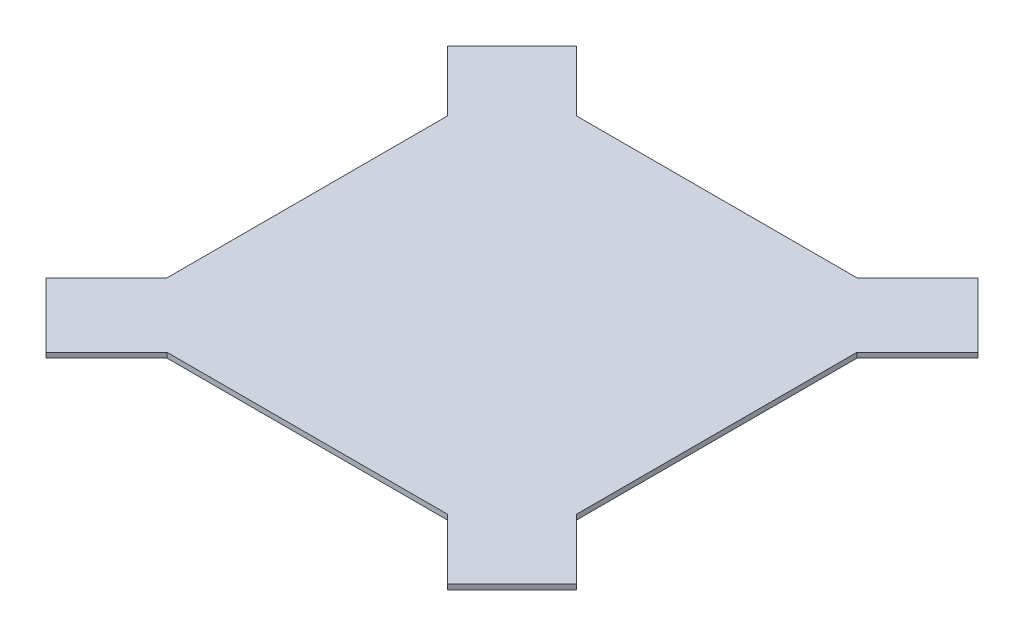
ISO-10303-21;
HEADER;
FILE_DESCRIPTION(('STEP AP214'),'2;1');
FILE_NAME('part.step','',(''),(''),'','','');
FILE_SCHEMA(('AUTOMOTIVE_DESIGN { 1 0 10303 214 1 1 1 1 }'));
ENDSEC;
DATA;
#1=APPLICATION_CONTEXT('core data for automotive mechanical design processes');
#2=APPLICATION_PROTOCOL_DEFINITION('international standard','automotive_design',2000,#1);
#3=PRODUCT_CONTEXT('',#1,'mechanical');
#4=PRODUCT('Part','Part','',(#3));
#5=PRODUCT_RELATED_PRODUCT_CATEGORY('part','',(#4));
#6=PRODUCT_DEFINITION_FORMATION('','',#4);
#7=PRODUCT_DEFINITION_CONTEXT('part definition',#1,'design');
#8=PRODUCT_DEFINITION('design','',#6,#7);
#9=PRODUCT_DEFINITION_SHAPE('','',#8);
#10=(LENGTH_UNIT() NAMED_UNIT(*) SI_UNIT(.MILLI.,.METRE.));
#11=(NAMED_UNIT(*) PLANE_ANGLE_UNIT() SI_UNIT($,.RADIAN.));
#12=(NAMED_UNIT(*) SI_UNIT($,.STERADIAN.) SOLID_ANGLE_UNIT());
#13=UNCERTAINTY_MEASURE_WITH_UNIT(LENGTH_MEASURE(1.E-05),#10,'distance_accuracy_value','');
#14=(GEOMETRIC_REPRESENTATION_CONTEXT(3) GLOBAL_UNCERTAINTY_ASSIGNED_CONTEXT((#13)) GLOBAL_UNIT_ASSIGNED_CONTEXT((#10,
#11,#12)) REPRESENTATION_CONTEXT('',''));
#15=CARTESIAN_POINT('',(0.,0.,0.));
#16=DIRECTION('',(0.,0.,1.));
#17=DIRECTION('',(1.,0.,0.));
#18=AXIS2_PLACEMENT_3D('',#15,#16,#17);
#19=CARTESIAN_POINT('',(0.,-6.35,0.));
#20=DIRECTION('',(0.,1.,0.));
#21=DIRECTION('',(0.,0.,1.));
#22=AXIS2_PLACEMENT_3D('',#19,#20,#21);
#23=PLANE('',#22);
#24=DIRECTION('',(0.707106781186547,0.,0.707106781186548));
#25=VECTOR('',#24,1.);
#26=CARTESIAN_POINT('',(-40.4111525448105,-6.35,40.4111525448104));
#27=LINE('',#26,#25);
#28=CARTESIAN_POINT('',(175.260000044,-6.35,256.082305133621));
#29=VERTEX_POINT('',#28);
#30=CARTESIAN_POINT('',(251.046104704089,-6.35,331.86840979371));
#31=VERTEX_POINT('',#30);
#32=EDGE_CURVE('E344',#29,#31,#27,.T.);
#33=ORIENTED_EDGE('',*,*,#32,.F.);
#34=DIRECTION('',(-1.,0.,0.));
#35=VECTOR('',#34,1.);
#36=CARTESIAN_POINT('',(0.,-6.35,256.082305133621));
#37=LINE('',#36,#35);
#38=CARTESIAN_POINT('',(-175.260000044,-6.35,256.082305133621));
#39=VERTEX_POINT('',#38);
#40=EDGE_CURVE('E329',#29,#39,#37,.T.);
#41=ORIENTED_EDGE('',*,*,#40,.T.);
#42=DIRECTION('',(-0.707106781186547,0.,0.707106781186548));
#43=VECTOR('',#42,1.);
#44=CARTESIAN_POINT('',(40.4111525448105,-6.35,40.4111525448104));
#45=LINE('',#44,#43);
#46=CARTESIAN_POINT('',(-251.046104704089,-6.35,331.86840979371));
#47=VERTEX_POINT('',#46);
#48=EDGE_CURVE('E348',#39,#47,#45,.T.);
#49=ORIENTED_EDGE('',*,*,#48,.T.);
#50=DIRECTION('',(0.707106781186549,0.,0.707106781186546));
#51=VECTOR('',#50,1.);
#52=CARTESIAN_POINT('',(-291.457257248899,-6.35,291.4572572489));
#53=LINE('',#52,#51);
#54=CARTESIAN_POINT('',(-331.868409793711,-6.35,251.046104704089));
#55=VERTEX_POINT('',#54);
#56=EDGE_CURVE('E388',#55,#47,#53,.T.);
#57=ORIENTED_EDGE('',*,*,#56,.F.);
#58=DIRECTION('',(-0.707106781186551,0.,0.707106781186544));
#59=VECTOR('',#58,1.);
#60=CARTESIAN_POINT('',(-40.4111525448092,-6.35,-40.4111525448096));
#61=LINE('',#60,#59);
#62=CARTESIAN_POINT('',(-256.082305133621,-6.35,175.260000044));
#63=VERTEX_POINT('',#62);
#64=EDGE_CURVE('E391',#63,#55,#61,.T.);
#65=ORIENTED_EDGE('',*,*,#64,.F.);
#66=DIRECTION('',(0.,0.,1.));
#67=VECTOR('',#66,1.);
#68=CARTESIAN_POINT('',(-256.082305133621,-6.35,0.));
#69=LINE('',#68,#67);
#70=CARTESIAN_POINT('',(-256.082305133621,-6.35,-175.260000044));
#71=VERTEX_POINT('',#70);
#72=EDGE_CURVE('E340',#71,#63,#69,.T.);
#73=ORIENTED_EDGE('',*,*,#72,.F.);
#74=DIRECTION('',(-0.707106781186551,0.,-0.707106781186544));
#75=VECTOR('',#74,1.);
#76=CARTESIAN_POINT('',(-40.4111525448092,-6.35,40.4111525448096));
#77=LINE('',#76,#75);
#78=CARTESIAN_POINT('',(-331.868409793711,-6.35,-251.046104704089));
#79=VERTEX_POINT('',#78);
#80=EDGE_CURVE('E434',#71,#79,#77,.T.);
#81=ORIENTED_EDGE('',*,*,#80,.T.);
#82=DIRECTION('',(0.707106781186549,0.,-0.707106781186546));
#83=VECTOR('',#82,1.);
#84=CARTESIAN_POINT('',(-291.457257248899,-6.35,-291.4572572489));
#85=LINE('',#84,#83);
#86=CARTESIAN_POINT('',(-251.046104704089,-6.35,-331.86840979371));
#87=VERTEX_POINT('',#86);
#88=EDGE_CURVE('E500',#79,#87,#85,.T.);
#89=ORIENTED_EDGE('',*,*,#88,.T.);
#90=DIRECTION('',(-0.707106781186547,0.,-0.707106781186548));
#91=VECTOR('',#90,1.);
#92=CARTESIAN_POINT('',(40.4111525448105,-6.35,-40.4111525448104));
#93=LINE('',#92,#91);
#94=CARTESIAN_POINT('',(-175.260000044,-6.35,-256.082305133621));
#95=VERTEX_POINT('',#94);
#96=EDGE_CURVE('E489',#95,#87,#93,.T.);
#97=ORIENTED_EDGE('',*,*,#96,.F.);
#98=DIRECTION('',(1.,0.,0.));
#99=VECTOR('',#98,1.);
#100=CARTESIAN_POINT('',(0.,-6.35,-256.082305133621));
#101=LINE('',#100,#99);
#102=CARTESIAN_POINT('',(175.260000044,-6.35,-256.082305133621));
#103=VERTEX_POINT('',#102);
#104=EDGE_CURVE('E454',#95,#103,#101,.T.);
#105=ORIENTED_EDGE('',*,*,#104,.T.);
#106=DIRECTION('',(0.707106781186547,0.,-0.707106781186548));
#107=VECTOR('',#106,1.);
#108=CARTESIAN_POINT('',(-40.4111525448105,-6.35,-40.4111525448104));
#109=LINE('',#108,#107);
#110=CARTESIAN_POINT('',(251.046104704089,-6.35,-331.86840979371));
#111=VERTEX_POINT('',#110);
#112=EDGE_CURVE('E445',#103,#111,#109,.T.);
#113=ORIENTED_EDGE('',*,*,#112,.T.);
#114=DIRECTION('',(-0.707106781186549,0.,-0.707106781186546));
#115=VECTOR('',#114,1.);
#116=CARTESIAN_POINT('',(291.457257248899,-6.35,-291.4572572489));
#117=LINE('',#116,#115);
#118=CARTESIAN_POINT('',(331.868409793711,-6.35,-251.046104704089));
#119=VERTEX_POINT('',#118);
#120=EDGE_CURVE('E448',#119,#111,#117,.T.);
#121=ORIENTED_EDGE('',*,*,#120,.F.);
#122=DIRECTION('',(0.707106781186551,0.,-0.707106781186544));
#123=VECTOR('',#122,1.);
#124=CARTESIAN_POINT('',(40.4111525448092,-6.35,40.4111525448096));
#125=LINE('',#124,#123);
#126=CARTESIAN_POINT('',(256.082305133621,-6.35,-175.260000044));
#127=VERTEX_POINT('',#126);
#128=EDGE_CURVE('E451',#127,#119,#125,.T.);
#129=ORIENTED_EDGE('',*,*,#128,.F.);
#130=DIRECTION('',(0.,0.,1.));
#131=VECTOR('',#130,1.);
#132=CARTESIAN_POINT('',(256.082305133621,-6.35,0.));
#133=LINE('',#132,#131);
#134=CARTESIAN_POINT('',(256.082305133621,-6.35,175.260000044));
#135=VERTEX_POINT('',#134);
#136=EDGE_CURVE('E367',#127,#135,#133,.T.);
#137=ORIENTED_EDGE('',*,*,#136,.T.);
#138=DIRECTION('',(0.707106781186551,0.,0.707106781186544));
#139=VECTOR('',#138,1.);
#140=CARTESIAN_POINT('',(40.4111525448092,-6.35,-40.4111525448096));
#141=LINE('',#140,#139);
#142=CARTESIAN_POINT('',(331.868409793711,-6.35,251.046104704089));
#143=VERTEX_POINT('',#142);
#144=EDGE_CURVE('E356',#135,#143,#141,.T.);
#145=ORIENTED_EDGE('',*,*,#144,.T.);
#146=DIRECTION('',(-0.707106781186549,0.,0.707106781186546));
#147=VECTOR('',#146,1.);
#148=CARTESIAN_POINT('',(291.457257248899,-6.35,291.4572572489));
#149=LINE('',#148,#147);
#150=EDGE_CURVE('E353',#143,#31,#149,.T.);
#151=ORIENTED_EDGE('',*,*,#150,.T.);
#152=EDGE_LOOP('',(#33,#41,#49,#57,#65,#73,#81,#89,#97,#105,#113,#121,#129,#137,#145,#151));
#153=FACE_BOUND('',#152,.T.);
#154=ADVANCED_FACE('F213',(#153),#23,.F.);
#155=CARTESIAN_POINT('',(0.,0.,0.));
#156=DIRECTION('',(0.,1.,0.));
#157=DIRECTION('',(0.,0.,1.));
#158=AXIS2_PLACEMENT_3D('',#155,#156,#157);
#159=PLANE('',#158);
#160=DIRECTION('',(1.,0.,0.));
#161=VECTOR('',#160,1.);
#162=CARTESIAN_POINT('',(0.,0.,256.082305133621));
#163=LINE('',#162,#161);
#164=CARTESIAN_POINT('',(-175.260000044,0.,256.082305133621));
#165=VERTEX_POINT('',#164);
#166=CARTESIAN_POINT('',(175.260000044,0.,256.082305133621));
#167=VERTEX_POINT('',#166);
#168=EDGE_CURVE('E404',#165,#167,#163,.T.);
#169=ORIENTED_EDGE('',*,*,#168,.T.);
#170=DIRECTION('',(-0.707106781186547,0.,-0.707106781186548));
#171=VECTOR('',#170,1.);
#172=CARTESIAN_POINT('',(-40.4111525448105,0.,40.4111525448104));
#173=LINE('',#172,#171);
#174=CARTESIAN_POINT('',(251.046104704089,0.,331.86840979371));
#175=VERTEX_POINT('',#174);
#176=EDGE_CURVE('E347',#175,#167,#173,.T.);
#177=ORIENTED_EDGE('',*,*,#176,.F.);
#178=DIRECTION('',(0.707106781186549,0.,-0.707106781186547));
#179=VECTOR('',#178,1.);
#180=CARTESIAN_POINT('',(291.457257248899,0.,291.4572572489));
#181=LINE('',#180,#179);
#182=CARTESIAN_POINT('',(331.868409793711,0.,251.046104704089));
#183=VERTEX_POINT('',#182);
#184=EDGE_CURVE('E377',#175,#183,#181,.T.);
#185=ORIENTED_EDGE('',*,*,#184,.T.);
#186=DIRECTION('',(-0.707106781186551,0.,-0.707106781186544));
#187=VECTOR('',#186,1.);
#188=CARTESIAN_POINT('',(40.4111525448092,0.,-40.4111525448096));
#189=LINE('',#188,#187);
#190=CARTESIAN_POINT('',(256.082305133621,0.,175.260000044));
#191=VERTEX_POINT('',#190);
#192=EDGE_CURVE('E374',#183,#191,#189,.T.);
#193=ORIENTED_EDGE('',*,*,#192,.T.);
#194=DIRECTION('',(0.,0.,-1.));
#195=VECTOR('',#194,1.);
#196=CARTESIAN_POINT('',(256.082305133621,0.,0.));
#197=LINE('',#196,#195);
#198=CARTESIAN_POINT('',(256.082305133621,0.,-175.260000044));
#199=VERTEX_POINT('',#198);
#200=EDGE_CURVE('E371',#191,#199,#197,.T.);
#201=ORIENTED_EDGE('',*,*,#200,.T.);
#202=DIRECTION('',(-0.707106781186551,0.,0.707106781186544));
#203=VECTOR('',#202,1.);
#204=CARTESIAN_POINT('',(40.4111525448092,0.,40.4111525448096));
#205=LINE('',#204,#203);
#206=CARTESIAN_POINT('',(331.868409793711,0.,-251.046104704089));
#207=VERTEX_POINT('',#206);
#208=EDGE_CURVE('E462',#207,#199,#205,.T.);
#209=ORIENTED_EDGE('',*,*,#208,.F.);
#210=DIRECTION('',(0.707106781186549,0.,0.707106781186547));
#211=VECTOR('',#210,1.);
#212=CARTESIAN_POINT('',(291.457257248899,0.,-291.4572572489));
#213=LINE('',#212,#211);
#214=CARTESIAN_POINT('',(251.046104704089,0.,-331.86840979371));
#215=VERTEX_POINT('',#214);
#216=EDGE_CURVE('E459',#215,#207,#213,.T.);
#217=ORIENTED_EDGE('',*,*,#216,.F.);
#218=DIRECTION('',(-0.707106781186547,0.,0.707106781186548));
#219=VECTOR('',#218,1.);
#220=CARTESIAN_POINT('',(-40.4111525448105,0.,-40.4111525448104));
#221=LINE('',#220,#219);
#222=CARTESIAN_POINT('',(175.260000044,0.,-256.082305133621));
#223=VERTEX_POINT('',#222);
#224=EDGE_CURVE('E456',#215,#223,#221,.T.);
#225=ORIENTED_EDGE('',*,*,#224,.T.);
#226=DIRECTION('',(-1.,0.,0.));
#227=VECTOR('',#226,1.);
#228=CARTESIAN_POINT('',(0.,0.,-256.082305133621));
#229=LINE('',#228,#227);
#230=CARTESIAN_POINT('',(-175.260000044,0.,-256.082305133621));
#231=VERTEX_POINT('',#230);
#232=EDGE_CURVE('E466',#223,#231,#229,.T.);
#233=ORIENTED_EDGE('',*,*,#232,.T.);
#234=DIRECTION('',(0.707106781186547,0.,0.707106781186548));
#235=VECTOR('',#234,1.);
#236=CARTESIAN_POINT('',(40.4111525448105,0.,-40.4111525448104));
#237=LINE('',#236,#235);
#238=CARTESIAN_POINT('',(-251.046104704089,0.,-331.86840979371));
#239=VERTEX_POINT('',#238);
#240=EDGE_CURVE('E436',#239,#231,#237,.T.);
#241=ORIENTED_EDGE('',*,*,#240,.F.);
#242=DIRECTION('',(-0.707106781186549,0.,0.707106781186547));
#243=VECTOR('',#242,1.);
#244=CARTESIAN_POINT('',(-291.457257248899,0.,-291.4572572489));
#245=LINE('',#244,#243);
#246=CARTESIAN_POINT('',(-331.868409793711,0.,-251.046104704089));
#247=VERTEX_POINT('',#246);
#248=EDGE_CURVE('E441',#239,#247,#245,.T.);
#249=ORIENTED_EDGE('',*,*,#248,.T.);
#250=DIRECTION('',(0.707106781186551,0.,0.707106781186544));
#251=VECTOR('',#250,1.);
#252=CARTESIAN_POINT('',(-40.4111525448092,0.,40.4111525448096));
#253=LINE('',#252,#251);
#254=CARTESIAN_POINT('',(-256.082305133621,0.,-175.260000044));
#255=VERTEX_POINT('',#254);
#256=EDGE_CURVE('E426',#247,#255,#253,.T.);
#257=ORIENTED_EDGE('',*,*,#256,.T.);
#258=DIRECTION('',(0.,0.,-1.));
#259=VECTOR('',#258,1.);
#260=CARTESIAN_POINT('',(-256.082305133621,0.,0.));
#261=LINE('',#260,#259);
#262=CARTESIAN_POINT('',(-256.082305133621,0.,175.260000044));
#263=VERTEX_POINT('',#262);
#264=EDGE_CURVE('E402',#263,#255,#261,.T.);
#265=ORIENTED_EDGE('',*,*,#264,.F.);
#266=DIRECTION('',(0.707106781186551,0.,-0.707106781186544));
#267=VECTOR('',#266,1.);
#268=CARTESIAN_POINT('',(-40.4111525448092,0.,-40.4111525448096));
#269=LINE('',#268,#267);
#270=CARTESIAN_POINT('',(-331.868409793711,0.,251.046104704089));
#271=VERTEX_POINT('',#270);
#272=EDGE_CURVE('E400',#271,#263,#269,.T.);
#273=ORIENTED_EDGE('',*,*,#272,.F.);
#274=DIRECTION('',(-0.707106781186549,0.,-0.707106781186547));
#275=VECTOR('',#274,1.);
#276=CARTESIAN_POINT('',(-291.457257248899,0.,291.4572572489));
#277=LINE('',#276,#275);
#278=CARTESIAN_POINT('',(-251.046104704089,0.,331.86840979371));
#279=VERTEX_POINT('',#278);
#280=EDGE_CURVE('E397',#279,#271,#277,.T.);
#281=ORIENTED_EDGE('',*,*,#280,.F.);
#282=DIRECTION('',(0.707106781186547,0.,-0.707106781186548));
#283=VECTOR('',#282,1.);
#284=CARTESIAN_POINT('',(40.4111525448105,0.,40.4111525448104));
#285=LINE('',#284,#283);
#286=EDGE_CURVE('E339',#279,#165,#285,.T.);
#287=ORIENTED_EDGE('',*,*,#286,.T.);
#288=EDGE_LOOP('',(#169,#177,#185,#193,#201,#209,#217,#225,#233,#241,#249,#257,#265,#273,#281,#287));
#289=FACE_BOUND('',#288,.T.);
#290=ADVANCED_FACE('F215',(#289),#159,.T.);
#291=CARTESIAN_POINT('',(0.,-6.351,256.082305133621));
#292=DIRECTION('',(0.,0.,1.));
#293=DIRECTION('',(1.,0.,0.));
#294=AXIS2_PLACEMENT_3D('',#291,#292,#293);
#295=PLANE('',#294);
#296=ORIENTED_EDGE('',*,*,#40,.F.);
#297=DIRECTION('',(0.,1.,0.));
#298=VECTOR('',#297,1.);
#299=CARTESIAN_POINT('',(175.260000044,-6.351,256.082305133621));
#300=LINE('',#299,#298);
#301=EDGE_CURVE('E332',#29,#167,#300,.T.);
#302=ORIENTED_EDGE('',*,*,#301,.T.);
#303=ORIENTED_EDGE('',*,*,#168,.F.);
#304=DIRECTION('',(0.,1.,0.));
#305=VECTOR('',#304,1.);
#306=CARTESIAN_POINT('',(-175.260000044,-6.351,256.082305133621));
#307=LINE('',#306,#305);
#308=EDGE_CURVE('E217',#39,#165,#307,.T.);
#309=ORIENTED_EDGE('',*,*,#308,.F.);
#310=EDGE_LOOP('',(#296,#302,#303,#309));
#311=FACE_BOUND('',#310,.T.);
#312=ADVANCED_FACE('F331',(#311),#295,.T.);
#313=CARTESIAN_POINT('',(-256.082305133621,-6.351,0.));
#314=DIRECTION('',(1.,0.,0.));
#315=DIRECTION('',(0.,0.,-1.));
#316=AXIS2_PLACEMENT_3D('',#313,#314,#315);
#317=PLANE('',#316);
#318=ORIENTED_EDGE('',*,*,#72,.T.);
#319=DIRECTION('',(0.,1.,0.));
#320=VECTOR('',#319,1.);
#321=CARTESIAN_POINT('',(-256.082305133621,-6.351,175.260000044));
#322=LINE('',#321,#320);
#323=EDGE_CURVE('E12',#63,#263,#322,.T.);
#324=ORIENTED_EDGE('',*,*,#323,.T.);
#325=ORIENTED_EDGE('',*,*,#264,.T.);
#326=DIRECTION('',(0.,1.,0.));
#327=VECTOR('',#326,1.);
#328=CARTESIAN_POINT('',(-256.082305133621,-6.351,-175.260000044));
#329=LINE('',#328,#327);
#330=EDGE_CURVE('E430',#71,#255,#329,.T.);
#331=ORIENTED_EDGE('',*,*,#330,.F.);
#332=EDGE_LOOP('',(#318,#324,#325,#331));
#333=FACE_BOUND('',#332,.T.);
#334=ADVANCED_FACE('F429',(#333),#317,.F.);
#335=CARTESIAN_POINT('',(-40.4111525448092,-6.351,-40.4111525448096));
#336=DIRECTION('',(0.707106781186544,0.,0.707106781186551));
#337=DIRECTION('',(0.707106781186551,0.,-0.707106781186544));
#338=AXIS2_PLACEMENT_3D('',#335,#336,#337);
#339=PLANE('',#338);
#340=ORIENTED_EDGE('',*,*,#64,.T.);
#341=DIRECTION('',(0.,1.,0.));
#342=VECTOR('',#341,1.);
#343=CARTESIAN_POINT('',(-331.868409793711,-6.351,251.046104704089));
#344=LINE('',#343,#342);
#345=EDGE_CURVE('E222',#55,#271,#344,.T.);
#346=ORIENTED_EDGE('',*,*,#345,.T.);
#347=ORIENTED_EDGE('',*,*,#272,.T.);
#348=ORIENTED_EDGE('',*,*,#323,.F.);
#349=EDGE_LOOP('',(#340,#346,#347,#348));
#350=FACE_BOUND('',#349,.T.);
#351=ADVANCED_FACE('F422',(#350),#339,.F.);
#352=CARTESIAN_POINT('',(-291.457257248899,-6.351,291.4572572489));
#353=DIRECTION('',(0.707106781186547,0.,-0.707106781186549));
#354=DIRECTION('',(-0.707106781186549,0.,-0.707106781186546));
#355=AXIS2_PLACEMENT_3D('',#352,#353,#354);
#356=PLANE('',#355);
#357=ORIENTED_EDGE('',*,*,#56,.T.);
#358=DIRECTION('',(0.,1.,0.));
#359=VECTOR('',#358,1.);
#360=CARTESIAN_POINT('',(-251.046104704089,-6.351,331.86840979371));
#361=LINE('',#360,#359);
#362=EDGE_CURVE('E406',#47,#279,#361,.T.);
#363=ORIENTED_EDGE('',*,*,#362,.T.);
#364=ORIENTED_EDGE('',*,*,#280,.T.);
#365=ORIENTED_EDGE('',*,*,#345,.F.);
#366=EDGE_LOOP('',(#357,#363,#364,#365));
#367=FACE_BOUND('',#366,.T.);
#368=ADVANCED_FACE('F417',(#367),#356,.F.);
#369=CARTESIAN_POINT('',(40.4111525448105,-6.351,40.4111525448104));
#370=DIRECTION('',(0.707106781186548,0.,0.707106781186547));
#371=DIRECTION('',(0.707106781186547,0.,-0.707106781186548));
#372=AXIS2_PLACEMENT_3D('',#369,#370,#371);
#373=PLANE('',#372);
#374=ORIENTED_EDGE('',*,*,#308,.T.);
#375=ORIENTED_EDGE('',*,*,#286,.F.);
#376=ORIENTED_EDGE('',*,*,#362,.F.);
#377=ORIENTED_EDGE('',*,*,#48,.F.);
#378=EDGE_LOOP('',(#374,#375,#376,#377));
#379=FACE_BOUND('',#378,.T.);
#380=ADVANCED_FACE('F412',(#379),#373,.T.);
#381=CARTESIAN_POINT('',(-40.4111525448105,-6.351,40.4111525448104));
#382=DIRECTION('',(0.707106781186548,0.,-0.707106781186547));
#383=DIRECTION('',(-0.707106781186547,0.,-0.707106781186548));
#384=AXIS2_PLACEMENT_3D('',#381,#382,#383);
#385=PLANE('',#384);
#386=ORIENTED_EDGE('',*,*,#32,.T.);
#387=DIRECTION('',(0.,1.,0.));
#388=VECTOR('',#387,1.);
#389=CARTESIAN_POINT('',(251.046104704089,-6.351,331.86840979371));
#390=LINE('',#389,#388);
#391=EDGE_CURVE('E349',#31,#175,#390,.T.);
#392=ORIENTED_EDGE('',*,*,#391,.T.);
#393=ORIENTED_EDGE('',*,*,#176,.T.);
#394=ORIENTED_EDGE('',*,*,#301,.F.);
#395=EDGE_LOOP('',(#386,#392,#393,#394));
#396=FACE_BOUND('',#395,.T.);
#397=ADVANCED_FACE('F343',(#396),#385,.F.);
#398=CARTESIAN_POINT('',(291.457257248899,-6.351,291.4572572489));
#399=DIRECTION('',(0.707106781186547,0.,0.707106781186549));
#400=DIRECTION('',(0.707106781186549,0.,-0.707106781186546));
#401=AXIS2_PLACEMENT_3D('',#398,#399,#400);
#402=PLANE('',#401);
#403=DIRECTION('',(0.,1.,0.));
#404=VECTOR('',#403,1.);
#405=CARTESIAN_POINT('',(331.868409793711,-6.351,251.046104704089));
#406=LINE('',#405,#404);
#407=EDGE_CURVE('E383',#143,#183,#406,.T.);
#408=ORIENTED_EDGE('',*,*,#407,.T.);
#409=ORIENTED_EDGE('',*,*,#184,.F.);
#410=ORIENTED_EDGE('',*,*,#391,.F.);
#411=ORIENTED_EDGE('',*,*,#150,.F.);
#412=EDGE_LOOP('',(#408,#409,#410,#411));
#413=FACE_BOUND('',#412,.T.);
#414=ADVANCED_FACE('F535',(#413),#402,.T.);
#415=CARTESIAN_POINT('',(40.4111525448092,-6.351,-40.4111525448096));
#416=DIRECTION('',(0.707106781186544,0.,-0.707106781186551));
#417=DIRECTION('',(-0.707106781186551,0.,-0.707106781186544));
#418=AXIS2_PLACEMENT_3D('',#415,#416,#417);
#419=PLANE('',#418);
#420=DIRECTION('',(0.,1.,0.));
#421=VECTOR('',#420,1.);
#422=CARTESIAN_POINT('',(256.082305133621,-6.351,175.260000044));
#423=LINE('',#422,#421);
#424=EDGE_CURVE('E380',#135,#191,#423,.T.);
#425=ORIENTED_EDGE('',*,*,#424,.T.);
#426=ORIENTED_EDGE('',*,*,#192,.F.);
#427=ORIENTED_EDGE('',*,*,#407,.F.);
#428=ORIENTED_EDGE('',*,*,#144,.F.);
#429=EDGE_LOOP('',(#425,#426,#427,#428));
#430=FACE_BOUND('',#429,.T.);
#431=ADVANCED_FACE('F531',(#430),#419,.T.);
#432=CARTESIAN_POINT('',(256.082305133621,-6.351,0.));
#433=DIRECTION('',(1.,0.,0.));
#434=DIRECTION('',(0.,0.,-1.));
#435=AXIS2_PLACEMENT_3D('',#432,#433,#434);
#436=PLANE('',#435);
#437=ORIENTED_EDGE('',*,*,#136,.F.);
#438=DIRECTION('',(0.,1.,0.));
#439=VECTOR('',#438,1.);
#440=CARTESIAN_POINT('',(256.082305133621,-6.351,-175.260000044));
#441=LINE('',#440,#439);
#442=EDGE_CURVE('E354',#127,#199,#441,.T.);
#443=ORIENTED_EDGE('',*,*,#442,.T.);
#444=ORIENTED_EDGE('',*,*,#200,.F.);
#445=ORIENTED_EDGE('',*,*,#424,.F.);
#446=EDGE_LOOP('',(#437,#443,#444,#445));
#447=FACE_BOUND('',#446,.T.);
#448=ADVANCED_FACE('F528',(#447),#436,.T.);
#449=CARTESIAN_POINT('',(0.,-6.351,-256.082305133621));
#450=DIRECTION('',(0.,0.,-1.));
#451=DIRECTION('',(-1.,0.,0.));
#452=AXIS2_PLACEMENT_3D('',#449,#450,#451);
#453=PLANE('',#452);
#454=ORIENTED_EDGE('',*,*,#104,.F.);
#455=DIRECTION('',(0.,1.,0.));
#456=VECTOR('',#455,1.);
#457=CARTESIAN_POINT('',(-175.260000044,-6.351,-256.082305133621));
#458=LINE('',#457,#456);
#459=EDGE_CURVE('E449',#95,#231,#458,.T.);
#460=ORIENTED_EDGE('',*,*,#459,.T.);
#461=ORIENTED_EDGE('',*,*,#232,.F.);
#462=DIRECTION('',(0.,1.,0.));
#463=VECTOR('',#462,1.);
#464=CARTESIAN_POINT('',(175.260000044,-6.351,-256.082305133621));
#465=LINE('',#464,#463);
#466=EDGE_CURVE('E363',#103,#223,#465,.T.);
#467=ORIENTED_EDGE('',*,*,#466,.F.);
#468=EDGE_LOOP('',(#454,#460,#461,#467));
#469=FACE_BOUND('',#468,.T.);
#470=ADVANCED_FACE('F491',(#469),#453,.T.);
#471=CARTESIAN_POINT('',(40.4111525448092,-6.351,40.4111525448096));
#472=DIRECTION('',(-0.707106781186544,0.,-0.707106781186551));
#473=DIRECTION('',(-0.707106781186551,0.,0.707106781186544));
#474=AXIS2_PLACEMENT_3D('',#471,#472,#473);
#475=PLANE('',#474);
#476=ORIENTED_EDGE('',*,*,#128,.T.);
#477=DIRECTION('',(0.,1.,0.));
#478=VECTOR('',#477,1.);
#479=CARTESIAN_POINT('',(331.868409793711,-6.351,-251.046104704089));
#480=LINE('',#479,#478);
#481=EDGE_CURVE('E360',#119,#207,#480,.T.);
#482=ORIENTED_EDGE('',*,*,#481,.T.);
#483=ORIENTED_EDGE('',*,*,#208,.T.);
#484=ORIENTED_EDGE('',*,*,#442,.F.);
#485=EDGE_LOOP('',(#476,#482,#483,#484));
#486=FACE_BOUND('',#485,.T.);
#487=ADVANCED_FACE('F546',(#486),#475,.F.);
#488=CARTESIAN_POINT('',(291.457257248899,-6.351,-291.4572572489));
#489=DIRECTION('',(-0.707106781186547,0.,0.707106781186549));
#490=DIRECTION('',(0.707106781186549,0.,0.707106781186546));
#491=AXIS2_PLACEMENT_3D('',#488,#489,#490);
#492=PLANE('',#491);
#493=ORIENTED_EDGE('',*,*,#120,.T.);
#494=DIRECTION('',(0.,1.,0.));
#495=VECTOR('',#494,1.);
#496=CARTESIAN_POINT('',(251.046104704089,-6.351,-331.86840979371));
#497=LINE('',#496,#495);
#498=EDGE_CURVE('E468',#111,#215,#497,.T.);
#499=ORIENTED_EDGE('',*,*,#498,.T.);
#500=ORIENTED_EDGE('',*,*,#216,.T.);
#501=ORIENTED_EDGE('',*,*,#481,.F.);
#502=EDGE_LOOP('',(#493,#499,#500,#501));
#503=FACE_BOUND('',#502,.T.);
#504=ADVANCED_FACE('F483',(#503),#492,.F.);
#505=CARTESIAN_POINT('',(-40.4111525448105,-6.351,-40.4111525448104));
#506=DIRECTION('',(-0.707106781186548,0.,-0.707106781186547));
#507=DIRECTION('',(-0.707106781186547,0.,0.707106781186548));
#508=AXIS2_PLACEMENT_3D('',#505,#506,#507);
#509=PLANE('',#508);
#510=ORIENTED_EDGE('',*,*,#466,.T.);
#511=ORIENTED_EDGE('',*,*,#224,.F.);
#512=ORIENTED_EDGE('',*,*,#498,.F.);
#513=ORIENTED_EDGE('',*,*,#112,.F.);
#514=EDGE_LOOP('',(#510,#511,#512,#513));
#515=FACE_BOUND('',#514,.T.);
#516=ADVANCED_FACE('F476',(#515),#509,.T.);
#517=CARTESIAN_POINT('',(40.4111525448105,-6.351,-40.4111525448104));
#518=DIRECTION('',(-0.707106781186548,0.,0.707106781186547));
#519=DIRECTION('',(0.707106781186547,0.,0.707106781186548));
#520=AXIS2_PLACEMENT_3D('',#517,#518,#519);
#521=PLANE('',#520);
#522=ORIENTED_EDGE('',*,*,#96,.T.);
#523=DIRECTION('',(0.,1.,0.));
#524=VECTOR('',#523,1.);
#525=CARTESIAN_POINT('',(-251.046104704089,-6.351,-331.86840979371));
#526=LINE('',#525,#524);
#527=EDGE_CURVE('E438',#87,#239,#526,.T.);
#528=ORIENTED_EDGE('',*,*,#527,.T.);
#529=ORIENTED_EDGE('',*,*,#240,.T.);
#530=ORIENTED_EDGE('',*,*,#459,.F.);
#531=EDGE_LOOP('',(#522,#528,#529,#530));
#532=FACE_BOUND('',#531,.T.);
#533=ADVANCED_FACE('F493',(#532),#521,.F.);
#534=CARTESIAN_POINT('',(-291.457257248899,-6.351,-291.4572572489));
#535=DIRECTION('',(-0.707106781186547,0.,-0.707106781186549));
#536=DIRECTION('',(-0.707106781186549,0.,0.707106781186546));
#537=AXIS2_PLACEMENT_3D('',#534,#535,#536);
#538=PLANE('',#537);
#539=DIRECTION('',(0.,1.,0.));
#540=VECTOR('',#539,1.);
#541=CARTESIAN_POINT('',(-331.868409793711,-6.351,-251.046104704089));
#542=LINE('',#541,#540);
#543=EDGE_CURVE('E435',#79,#247,#542,.T.);
#544=ORIENTED_EDGE('',*,*,#543,.T.);
#545=ORIENTED_EDGE('',*,*,#248,.F.);
#546=ORIENTED_EDGE('',*,*,#527,.F.);
#547=ORIENTED_EDGE('',*,*,#88,.F.);
#548=EDGE_LOOP('',(#544,#545,#546,#547));
#549=FACE_BOUND('',#548,.T.);
#550=ADVANCED_FACE('F503',(#549),#538,.T.);
#551=CARTESIAN_POINT('',(-40.4111525448092,-6.351,40.4111525448096));
#552=DIRECTION('',(-0.707106781186544,0.,0.707106781186551));
#553=DIRECTION('',(0.707106781186551,0.,0.707106781186544));
#554=AXIS2_PLACEMENT_3D('',#551,#552,#553);
#555=PLANE('',#554);
#556=ORIENTED_EDGE('',*,*,#330,.T.);
#557=ORIENTED_EDGE('',*,*,#256,.F.);
#558=ORIENTED_EDGE('',*,*,#543,.F.);
#559=ORIENTED_EDGE('',*,*,#80,.F.);
#560=EDGE_LOOP('',(#556,#557,#558,#559));
#561=FACE_BOUND('',#560,.T.);
#562=ADVANCED_FACE('F432',(#561),#555,.T.);
#563=CLOSED_SHELL('',(#154,#290,#312,#334,#351,#368,#380,#397,#414,#431,#448,#470,#487,#504,
#516,#533,#550,#562));
#564=MANIFOLD_SOLID_BREP('B2',#563);
#565=ADVANCED_BREP_SHAPE_REPRESENTATION('',(#18,#564),#14);
#566=SHAPE_DEFINITION_REPRESENTATION(#9,#565);
ENDSEC;
END-ISO-10303-21;
